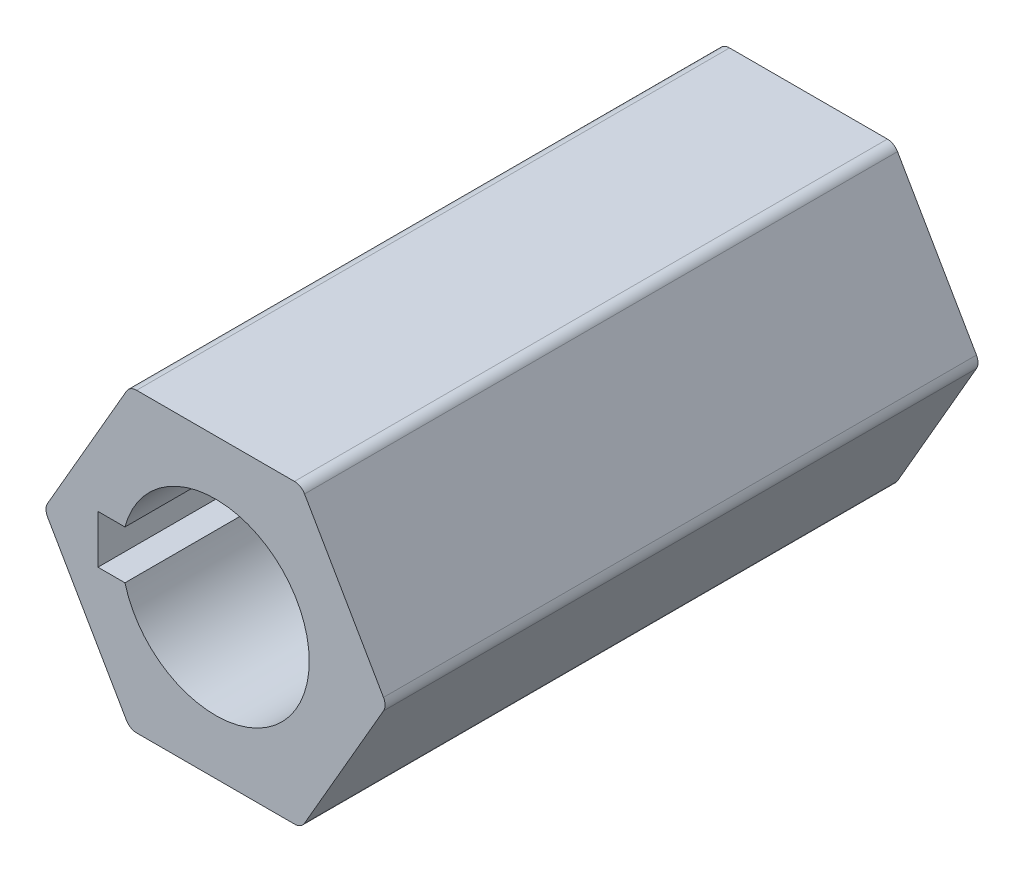
ISO-10303-21;
HEADER;
FILE_DESCRIPTION(('STEP AP214'),'2;1');
FILE_NAME('part.step','',(''),(''),'','','');
FILE_SCHEMA(('AUTOMOTIVE_DESIGN { 1 0 10303 214 1 1 1 1 }'));
ENDSEC;
DATA;
#1=APPLICATION_CONTEXT('core data for automotive mechanical design processes');
#2=APPLICATION_PROTOCOL_DEFINITION('international standard','automotive_design',2000,#1);
#3=PRODUCT_CONTEXT('',#1,'mechanical');
#4=PRODUCT('Part','Part','',(#3));
#5=PRODUCT_RELATED_PRODUCT_CATEGORY('part','',(#4));
#6=PRODUCT_DEFINITION_FORMATION('','',#4);
#7=PRODUCT_DEFINITION_CONTEXT('part definition',#1,'design');
#8=PRODUCT_DEFINITION('design','',#6,#7);
#9=PRODUCT_DEFINITION_SHAPE('','',#8);
#10=(LENGTH_UNIT() NAMED_UNIT(*) SI_UNIT(.MILLI.,.METRE.));
#11=(NAMED_UNIT(*) PLANE_ANGLE_UNIT() SI_UNIT($,.RADIAN.));
#12=(NAMED_UNIT(*) SI_UNIT($,.STERADIAN.) SOLID_ANGLE_UNIT());
#13=UNCERTAINTY_MEASURE_WITH_UNIT(LENGTH_MEASURE(1.E-05),#10,'distance_accuracy_value','');
#14=(GEOMETRIC_REPRESENTATION_CONTEXT(3) GLOBAL_UNCERTAINTY_ASSIGNED_CONTEXT((#13)) GLOBAL_UNIT_ASSIGNED_CONTEXT((#10,
#11,#12)) REPRESENTATION_CONTEXT('',''));
#15=CARTESIAN_POINT('',(0.,0.,0.));
#16=DIRECTION('',(0.,0.,1.));
#17=DIRECTION('',(1.,0.,0.));
#18=AXIS2_PLACEMENT_3D('',#15,#16,#17);
#19=CARTESIAN_POINT('',(6.76233049793735,0.,12.7));
#20=DIRECTION('',(0.,0.,-1.));
#21=DIRECTION('',(-1.,0.,0.));
#22=AXIS2_PLACEMENT_3D('',#19,#20,#21);
#23=CYLINDRICAL_SURFACE('',#22,0.5);
#24=CARTESIAN_POINT('',(6.76233049793735,0.,-12.7));
#25=DIRECTION('',(0.,0.,-1.));
#26=DIRECTION('',(-1.,0.,0.));
#27=AXIS2_PLACEMENT_3D('',#24,#25,#26);
#28=CIRCLE('',#27,0.5);
#29=CARTESIAN_POINT('',(7.19534319982957,-0.250000000000017,-12.7));
#30=VERTEX_POINT('',#29);
#31=CARTESIAN_POINT('',(7.19534319982957,0.249999999999985,-12.7));
#32=VERTEX_POINT('',#31);
#33=EDGE_CURVE('E130',#30,#32,#28,.F.);
#34=ORIENTED_EDGE('',*,*,#33,.T.);
#35=DIRECTION('',(0.,0.,1.));
#36=VECTOR('',#35,1.);
#37=CARTESIAN_POINT('',(7.19534319982957,0.249999999999985,12.7));
#38=LINE('',#37,#36);
#39=CARTESIAN_POINT('',(7.19534319982957,0.249999999999985,12.7));
#40=VERTEX_POINT('',#39);
#41=EDGE_CURVE('E128',#32,#40,#38,.T.);
#42=ORIENTED_EDGE('',*,*,#41,.T.);
#43=CARTESIAN_POINT('',(6.76233049793735,0.,12.7));
#44=DIRECTION('',(0.,0.,-1.));
#45=DIRECTION('',(-1.,0.,0.));
#46=AXIS2_PLACEMENT_3D('',#43,#44,#45);
#47=CIRCLE('',#46,0.5);
#48=CARTESIAN_POINT('',(7.19534319982957,-0.250000000000017,12.7));
#49=VERTEX_POINT('',#48);
#50=EDGE_CURVE('E19',#40,#49,#47,.T.);
#51=ORIENTED_EDGE('',*,*,#50,.T.);
#52=DIRECTION('',(0.,0.,1.));
#53=VECTOR('',#52,1.);
#54=CARTESIAN_POINT('',(7.19534319982957,-0.250000000000018,12.7));
#55=LINE('',#54,#53);
#56=EDGE_CURVE('E125',#49,#30,#55,.F.);
#57=ORIENTED_EDGE('',*,*,#56,.T.);
#58=EDGE_LOOP('',(#34,#42,#51,#57));
#59=FACE_BOUND('',#58,.T.);
#60=ADVANCED_FACE('F16',(#59),#23,.T.);
#61=CARTESIAN_POINT('',(3.38116524896868,5.85635,12.7));
#62=DIRECTION('',(0.,0.,-1.));
#63=DIRECTION('',(-1.,0.,0.));
#64=AXIS2_PLACEMENT_3D('',#61,#62,#63);
#65=CYLINDRICAL_SURFACE('',#64,0.5);
#66=CARTESIAN_POINT('',(3.38116524896868,5.85635,-12.7));
#67=DIRECTION('',(0.,0.,-1.));
#68=DIRECTION('',(-1.,0.,0.));
#69=AXIS2_PLACEMENT_3D('',#66,#67,#68);
#70=CIRCLE('',#69,0.5);
#71=CARTESIAN_POINT('',(3.8141779508609,6.10635,-12.7));
#72=VERTEX_POINT('',#71);
#73=CARTESIAN_POINT('',(3.38116524896868,6.35635,-12.7));
#74=VERTEX_POINT('',#73);
#75=EDGE_CURVE('E227',#72,#74,#70,.F.);
#76=ORIENTED_EDGE('',*,*,#75,.T.);
#77=DIRECTION('',(0.,0.,-1.));
#78=VECTOR('',#77,1.);
#79=CARTESIAN_POINT('',(3.38116524896868,6.35635,12.7));
#80=LINE('',#79,#78);
#81=CARTESIAN_POINT('',(3.38116524896868,6.35635,12.7));
#82=VERTEX_POINT('',#81);
#83=EDGE_CURVE('E194',#74,#82,#80,.F.);
#84=ORIENTED_EDGE('',*,*,#83,.T.);
#85=CARTESIAN_POINT('',(3.38116524896868,5.85635,12.7));
#86=DIRECTION('',(0.,0.,-1.));
#87=DIRECTION('',(-1.,0.,0.));
#88=AXIS2_PLACEMENT_3D('',#85,#86,#87);
#89=CIRCLE('',#88,0.5);
#90=CARTESIAN_POINT('',(3.8141779508609,6.10635,12.7));
#91=VERTEX_POINT('',#90);
#92=EDGE_CURVE('E229',#82,#91,#89,.T.);
#93=ORIENTED_EDGE('',*,*,#92,.T.);
#94=DIRECTION('',(0.,0.,1.));
#95=VECTOR('',#94,1.);
#96=CARTESIAN_POINT('',(3.8141779508609,6.10635,12.7));
#97=LINE('',#96,#95);
#98=EDGE_CURVE('E200',#91,#72,#97,.F.);
#99=ORIENTED_EDGE('',*,*,#98,.T.);
#100=EDGE_LOOP('',(#76,#84,#93,#99));
#101=FACE_BOUND('',#100,.T.);
#102=ADVANCED_FACE('F448',(#101),#65,.T.);
#103=CARTESIAN_POINT('',(-3.38116524896865,5.85635,12.7));
#104=DIRECTION('',(0.,0.,-1.));
#105=DIRECTION('',(-1.,0.,0.));
#106=AXIS2_PLACEMENT_3D('',#103,#104,#105);
#107=CYLINDRICAL_SURFACE('',#106,0.5);
#108=CARTESIAN_POINT('',(-3.38116524896865,5.85635,-12.7));
#109=DIRECTION('',(0.,0.,-1.));
#110=DIRECTION('',(-1.,0.,0.));
#111=AXIS2_PLACEMENT_3D('',#108,#109,#110);
#112=CIRCLE('',#111,0.5);
#113=CARTESIAN_POINT('',(-3.38116524896865,6.35635,-12.7));
#114=VERTEX_POINT('',#113);
#115=CARTESIAN_POINT('',(-3.81417795086087,6.10635,-12.7));
#116=VERTEX_POINT('',#115);
#117=EDGE_CURVE('E223',#114,#116,#112,.F.);
#118=ORIENTED_EDGE('',*,*,#117,.T.);
#119=DIRECTION('',(0.,0.,1.));
#120=VECTOR('',#119,1.);
#121=CARTESIAN_POINT('',(-3.81417795086087,6.10635,12.7));
#122=LINE('',#121,#120);
#123=CARTESIAN_POINT('',(-3.81417795086087,6.10635,12.7));
#124=VERTEX_POINT('',#123);
#125=EDGE_CURVE('E188',#116,#124,#122,.T.);
#126=ORIENTED_EDGE('',*,*,#125,.T.);
#127=CARTESIAN_POINT('',(-3.38116524896865,5.85635,12.7));
#128=DIRECTION('',(0.,0.,-1.));
#129=DIRECTION('',(-1.,0.,0.));
#130=AXIS2_PLACEMENT_3D('',#127,#128,#129);
#131=CIRCLE('',#130,0.5);
#132=CARTESIAN_POINT('',(-3.38116524896865,6.35635,12.7));
#133=VERTEX_POINT('',#132);
#134=EDGE_CURVE('E225',#124,#133,#131,.T.);
#135=ORIENTED_EDGE('',*,*,#134,.T.);
#136=DIRECTION('',(0.,0.,-1.));
#137=VECTOR('',#136,1.);
#138=CARTESIAN_POINT('',(-3.38116524896865,6.35635,12.7));
#139=LINE('',#138,#137);
#140=EDGE_CURVE('E191',#133,#114,#139,.T.);
#141=ORIENTED_EDGE('',*,*,#140,.T.);
#142=EDGE_LOOP('',(#118,#126,#135,#141));
#143=FACE_BOUND('',#142,.T.);
#144=ADVANCED_FACE('F265',(#143),#107,.T.);
#145=CARTESIAN_POINT('',(-6.76233049793731,0.,12.7));
#146=DIRECTION('',(0.,0.,-1.));
#147=DIRECTION('',(-1.,0.,0.));
#148=AXIS2_PLACEMENT_3D('',#145,#146,#147);
#149=CYLINDRICAL_SURFACE('',#148,0.5);
#150=CARTESIAN_POINT('',(-6.76233049793731,0.,-12.7));
#151=DIRECTION('',(0.,0.,-1.));
#152=DIRECTION('',(-1.,0.,0.));
#153=AXIS2_PLACEMENT_3D('',#150,#151,#152);
#154=CIRCLE('',#153,0.5);
#155=CARTESIAN_POINT('',(-7.19534319982953,0.249999999999998,-12.7));
#156=VERTEX_POINT('',#155);
#157=CARTESIAN_POINT('',(-7.19534319982953,-0.25,-12.7));
#158=VERTEX_POINT('',#157);
#159=EDGE_CURVE('E219',#156,#158,#154,.F.);
#160=ORIENTED_EDGE('',*,*,#159,.T.);
#161=DIRECTION('',(0.,0.,1.));
#162=VECTOR('',#161,1.);
#163=CARTESIAN_POINT('',(-7.19534319982953,-0.25,12.7));
#164=LINE('',#163,#162);
#165=CARTESIAN_POINT('',(-7.19534319982953,-0.25,12.7));
#166=VERTEX_POINT('',#165);
#167=EDGE_CURVE('E182',#158,#166,#164,.T.);
#168=ORIENTED_EDGE('',*,*,#167,.T.);
#169=CARTESIAN_POINT('',(-6.76233049793731,0.,12.7));
#170=DIRECTION('',(0.,0.,-1.));
#171=DIRECTION('',(-1.,0.,0.));
#172=AXIS2_PLACEMENT_3D('',#169,#170,#171);
#173=CIRCLE('',#172,0.5);
#174=CARTESIAN_POINT('',(-7.19534319982953,0.249999999999998,12.7));
#175=VERTEX_POINT('',#174);
#176=EDGE_CURVE('E221',#166,#175,#173,.T.);
#177=ORIENTED_EDGE('',*,*,#176,.T.);
#178=DIRECTION('',(0.,0.,1.));
#179=VECTOR('',#178,1.);
#180=CARTESIAN_POINT('',(-7.19534319982953,0.249999999999998,12.7));
#181=LINE('',#180,#179);
#182=EDGE_CURVE('E185',#175,#156,#181,.F.);
#183=ORIENTED_EDGE('',*,*,#182,.T.);
#184=EDGE_LOOP('',(#160,#168,#177,#183));
#185=FACE_BOUND('',#184,.T.);
#186=ADVANCED_FACE('F276',(#185),#149,.T.);
#187=CARTESIAN_POINT('',(3.38116524896867,-5.85635000000002,12.7));
#188=DIRECTION('',(0.,0.,-1.));
#189=DIRECTION('',(-1.,0.,0.));
#190=AXIS2_PLACEMENT_3D('',#187,#188,#189);
#191=CYLINDRICAL_SURFACE('',#190,0.5);
#192=CARTESIAN_POINT('',(3.38116524896867,-5.85635000000002,-12.7));
#193=DIRECTION('',(0.,0.,-1.));
#194=DIRECTION('',(-1.,0.,0.));
#195=AXIS2_PLACEMENT_3D('',#192,#193,#194);
#196=CIRCLE('',#195,0.5);
#197=CARTESIAN_POINT('',(3.38116524896867,-6.35635000000002,-12.7));
#198=VERTEX_POINT('',#197);
#199=CARTESIAN_POINT('',(3.81417795086089,-6.10635000000002,-12.7));
#200=VERTEX_POINT('',#199);
#201=EDGE_CURVE('E216',#198,#200,#196,.F.);
#202=ORIENTED_EDGE('',*,*,#201,.T.);
#203=DIRECTION('',(0.,0.,1.));
#204=VECTOR('',#203,1.);
#205=CARTESIAN_POINT('',(3.81417795086089,-6.10635000000002,12.7));
#206=LINE('',#205,#204);
#207=CARTESIAN_POINT('',(3.81417795086089,-6.10635000000002,12.7));
#208=VERTEX_POINT('',#207);
#209=EDGE_CURVE('E138',#200,#208,#206,.T.);
#210=ORIENTED_EDGE('',*,*,#209,.T.);
#211=CARTESIAN_POINT('',(3.38116524896867,-5.85635000000002,12.7));
#212=DIRECTION('',(0.,0.,-1.));
#213=DIRECTION('',(-1.,0.,0.));
#214=AXIS2_PLACEMENT_3D('',#211,#212,#213);
#215=CIRCLE('',#214,0.5);
#216=CARTESIAN_POINT('',(3.38116524896867,-6.35635000000002,12.7));
#217=VERTEX_POINT('',#216);
#218=EDGE_CURVE('E144',#208,#217,#215,.T.);
#219=ORIENTED_EDGE('',*,*,#218,.T.);
#220=DIRECTION('',(0.,0.,1.));
#221=VECTOR('',#220,1.);
#222=CARTESIAN_POINT('',(3.38116524896867,-6.35635000000002,12.7));
#223=LINE('',#222,#221);
#224=EDGE_CURVE('E178',#217,#198,#223,.F.);
#225=ORIENTED_EDGE('',*,*,#224,.T.);
#226=EDGE_LOOP('',(#202,#210,#219,#225));
#227=FACE_BOUND('',#226,.T.);
#228=ADVANCED_FACE('F294',(#227),#191,.T.);
#229=CARTESIAN_POINT('',(-3.38116524896863,-5.85635000000002,12.7));
#230=DIRECTION('',(0.,0.,-1.));
#231=DIRECTION('',(-1.,0.,0.));
#232=AXIS2_PLACEMENT_3D('',#229,#230,#231);
#233=CYLINDRICAL_SURFACE('',#232,0.5);
#234=CARTESIAN_POINT('',(-3.38116524896863,-5.85635000000002,-12.7));
#235=DIRECTION('',(0.,0.,-1.));
#236=DIRECTION('',(-1.,0.,0.));
#237=AXIS2_PLACEMENT_3D('',#234,#235,#236);
#238=CIRCLE('',#237,0.5);
#239=CARTESIAN_POINT('',(-3.81417795086084,-6.10635000000002,-12.7));
#240=VERTEX_POINT('',#239);
#241=CARTESIAN_POINT('',(-3.38116524896863,-6.35635000000002,-12.7));
#242=VERTEX_POINT('',#241);
#243=EDGE_CURVE('E139',#240,#242,#238,.F.);
#244=ORIENTED_EDGE('',*,*,#243,.T.);
#245=DIRECTION('',(0.,0.,1.));
#246=VECTOR('',#245,1.);
#247=CARTESIAN_POINT('',(-3.38116524896863,-6.35635000000002,12.7));
#248=LINE('',#247,#246);
#249=CARTESIAN_POINT('',(-3.38116524896863,-6.35635000000002,12.7));
#250=VERTEX_POINT('',#249);
#251=EDGE_CURVE('E160',#242,#250,#248,.T.);
#252=ORIENTED_EDGE('',*,*,#251,.T.);
#253=CARTESIAN_POINT('',(-3.38116524896863,-5.85635000000002,12.7));
#254=DIRECTION('',(0.,0.,-1.));
#255=DIRECTION('',(-1.,0.,0.));
#256=AXIS2_PLACEMENT_3D('',#253,#254,#255);
#257=CIRCLE('',#256,0.5);
#258=CARTESIAN_POINT('',(-3.81417795086084,-6.10635000000002,12.7));
#259=VERTEX_POINT('',#258);
#260=EDGE_CURVE('E214',#250,#259,#257,.T.);
#261=ORIENTED_EDGE('',*,*,#260,.T.);
#262=DIRECTION('',(0.,0.,1.));
#263=VECTOR('',#262,1.);
#264=CARTESIAN_POINT('',(-3.81417795086084,-6.10635000000002,12.7));
#265=LINE('',#264,#263);
#266=EDGE_CURVE('E181',#259,#240,#265,.F.);
#267=ORIENTED_EDGE('',*,*,#266,.T.);
#268=EDGE_LOOP('',(#244,#252,#261,#267));
#269=FACE_BOUND('',#268,.T.);
#270=ADVANCED_FACE('F284',(#269),#233,.T.);
#271=CARTESIAN_POINT('',(3.66984038356348,-6.35635000000002,12.7));
#272=DIRECTION('',(-0.866025403784438,0.500000000000001,0.));
#273=DIRECTION('',(-0.500000000000001,-0.866025403784438,0.));
#274=AXIS2_PLACEMENT_3D('',#271,#272,#273);
#275=PLANE('',#274);
#276=ORIENTED_EDGE('',*,*,#209,.F.);
#277=DIRECTION('',(0.500000000000001,0.866025403784438,0.));
#278=VECTOR('',#277,1.);
#279=CARTESIAN_POINT('',(3.81417795086089,-6.10635000000002,-12.7));
#280=LINE('',#279,#278);
#281=EDGE_CURVE('E137',#200,#30,#280,.T.);
#282=ORIENTED_EDGE('',*,*,#281,.T.);
#283=ORIENTED_EDGE('',*,*,#56,.F.);
#284=DIRECTION('',(0.500000000000001,0.866025403784438,0.));
#285=VECTOR('',#284,1.);
#286=CARTESIAN_POINT('',(3.81417795086089,-6.10635000000002,12.7));
#287=LINE('',#286,#285);
#288=EDGE_CURVE('E135',#208,#49,#287,.T.);
#289=ORIENTED_EDGE('',*,*,#288,.F.);
#290=EDGE_LOOP('',(#276,#282,#283,#289));
#291=FACE_BOUND('',#290,.T.);
#292=ADVANCED_FACE('F134',(#291),#275,.F.);
#293=CARTESIAN_POINT('',(7.33968076712697,0.,12.7));
#294=DIRECTION('',(-0.866025403784439,-0.5,0.));
#295=DIRECTION('',(0.5,-0.866025403784439,0.));
#296=AXIS2_PLACEMENT_3D('',#293,#294,#295);
#297=PLANE('',#296);
#298=ORIENTED_EDGE('',*,*,#41,.F.);
#299=DIRECTION('',(-0.5,0.866025403784439,0.));
#300=VECTOR('',#299,1.);
#301=CARTESIAN_POINT('',(7.19534319982957,0.249999999999985,-12.7));
#302=LINE('',#301,#300);
#303=EDGE_CURVE('E236',#32,#72,#302,.T.);
#304=ORIENTED_EDGE('',*,*,#303,.T.);
#305=ORIENTED_EDGE('',*,*,#98,.F.);
#306=DIRECTION('',(-0.5,0.866025403784439,0.));
#307=VECTOR('',#306,1.);
#308=CARTESIAN_POINT('',(7.19534319982957,0.249999999999985,12.7));
#309=LINE('',#308,#307);
#310=EDGE_CURVE('E146',#40,#91,#309,.T.);
#311=ORIENTED_EDGE('',*,*,#310,.F.);
#312=EDGE_LOOP('',(#298,#304,#305,#311));
#313=FACE_BOUND('',#312,.T.);
#314=ADVANCED_FACE('F234',(#313),#297,.F.);
#315=CARTESIAN_POINT('',(3.66984038356349,6.35635,12.7));
#316=DIRECTION('',(0.,-1.,0.));
#317=DIRECTION('',(0.,0.,-1.));
#318=AXIS2_PLACEMENT_3D('',#315,#316,#317);
#319=PLANE('',#318);
#320=ORIENTED_EDGE('',*,*,#140,.F.);
#321=DIRECTION('',(1.,0.,0.));
#322=VECTOR('',#321,1.);
#323=CARTESIAN_POINT('',(0.,6.35635,12.7));
#324=LINE('',#323,#322);
#325=EDGE_CURVE('E149',#82,#133,#324,.F.);
#326=ORIENTED_EDGE('',*,*,#325,.F.);
#327=ORIENTED_EDGE('',*,*,#83,.F.);
#328=DIRECTION('',(1.,0.,0.));
#329=VECTOR('',#328,1.);
#330=CARTESIAN_POINT('',(0.,6.35635,-12.7));
#331=LINE('',#330,#329);
#332=EDGE_CURVE('E239',#74,#114,#331,.F.);
#333=ORIENTED_EDGE('',*,*,#332,.T.);
#334=EDGE_LOOP('',(#320,#326,#327,#333));
#335=FACE_BOUND('',#334,.T.);
#336=ADVANCED_FACE('F263',(#335),#319,.F.);
#337=CARTESIAN_POINT('',(-3.66984038356347,6.35635,12.7));
#338=DIRECTION('',(0.866025403784439,-0.499999999999999,0.));
#339=DIRECTION('',(0.499999999999999,0.866025403784439,0.));
#340=AXIS2_PLACEMENT_3D('',#337,#338,#339);
#341=PLANE('',#340);
#342=ORIENTED_EDGE('',*,*,#182,.F.);
#343=DIRECTION('',(-0.499999999999999,-0.866025403784439,0.));
#344=VECTOR('',#343,1.);
#345=CARTESIAN_POINT('',(-3.81417795086087,6.10635,12.7));
#346=LINE('',#345,#344);
#347=EDGE_CURVE('E255',#124,#175,#346,.T.);
#348=ORIENTED_EDGE('',*,*,#347,.F.);
#349=ORIENTED_EDGE('',*,*,#125,.F.);
#350=DIRECTION('',(-0.499999999999999,-0.866025403784439,0.));
#351=VECTOR('',#350,1.);
#352=CARTESIAN_POINT('',(-3.81417795086087,6.10635,-12.7));
#353=LINE('',#352,#351);
#354=EDGE_CURVE('E242',#116,#156,#353,.T.);
#355=ORIENTED_EDGE('',*,*,#354,.T.);
#356=EDGE_LOOP('',(#342,#348,#349,#355));
#357=FACE_BOUND('',#356,.T.);
#358=ADVANCED_FACE('F272',(#357),#341,.F.);
#359=CARTESIAN_POINT('',(-7.33968076712694,0.,12.7));
#360=DIRECTION('',(0.866025403784438,0.500000000000001,0.));
#361=DIRECTION('',(-0.500000000000001,0.866025403784438,0.));
#362=AXIS2_PLACEMENT_3D('',#359,#360,#361);
#363=PLANE('',#362);
#364=ORIENTED_EDGE('',*,*,#266,.F.);
#365=DIRECTION('',(0.500000000000001,-0.866025403784438,0.));
#366=VECTOR('',#365,1.);
#367=CARTESIAN_POINT('',(-7.19534319982953,-0.25,12.7));
#368=LINE('',#367,#366);
#369=EDGE_CURVE('E151',#166,#259,#368,.T.);
#370=ORIENTED_EDGE('',*,*,#369,.F.);
#371=ORIENTED_EDGE('',*,*,#167,.F.);
#372=DIRECTION('',(0.500000000000001,-0.866025403784438,0.));
#373=VECTOR('',#372,1.);
#374=CARTESIAN_POINT('',(-7.19534319982953,-0.25,-12.7));
#375=LINE('',#374,#373);
#376=EDGE_CURVE('E282',#158,#240,#375,.T.);
#377=ORIENTED_EDGE('',*,*,#376,.T.);
#378=EDGE_LOOP('',(#364,#370,#371,#377));
#379=FACE_BOUND('',#378,.T.);
#380=ADVANCED_FACE('F281',(#379),#363,.F.);
#381=CARTESIAN_POINT('',(-3.66984038356344,-6.35635000000002,12.7));
#382=DIRECTION('',(0.,1.,0.));
#383=DIRECTION('',(0.,0.,1.));
#384=AXIS2_PLACEMENT_3D('',#381,#382,#383);
#385=PLANE('',#384);
#386=ORIENTED_EDGE('',*,*,#251,.F.);
#387=DIRECTION('',(1.,0.,0.));
#388=VECTOR('',#387,1.);
#389=CARTESIAN_POINT('',(0.,-6.35635000000002,-12.7));
#390=LINE('',#389,#388);
#391=EDGE_CURVE('E292',#242,#198,#390,.T.);
#392=ORIENTED_EDGE('',*,*,#391,.T.);
#393=ORIENTED_EDGE('',*,*,#224,.F.);
#394=DIRECTION('',(1.,0.,0.));
#395=VECTOR('',#394,1.);
#396=CARTESIAN_POINT('',(0.,-6.35635000000002,12.7));
#397=LINE('',#396,#395);
#398=EDGE_CURVE('E147',#250,#217,#397,.T.);
#399=ORIENTED_EDGE('',*,*,#398,.F.);
#400=EDGE_LOOP('',(#386,#392,#393,#399));
#401=FACE_BOUND('',#400,.T.);
#402=ADVANCED_FACE('F289',(#401),#385,.F.);
#403=CARTESIAN_POINT('',(-5.035,-1.035,12.7));
#404=DIRECTION('',(1.,0.,0.));
#405=DIRECTION('',(0.,0.,-1.));
#406=AXIS2_PLACEMENT_3D('',#403,#404,#405);
#407=PLANE('',#406);
#408=DIRECTION('',(0.,1.,0.));
#409=VECTOR('',#408,1.);
#410=CARTESIAN_POINT('',(-5.035,0.,12.7));
#411=LINE('',#410,#409);
#412=CARTESIAN_POINT('',(-5.035,-1.035,12.7));
#413=VERTEX_POINT('',#412);
#414=CARTESIAN_POINT('',(-5.035,1.035,12.7));
#415=VERTEX_POINT('',#414);
#416=EDGE_CURVE('E173',#413,#415,#411,.T.);
#417=ORIENTED_EDGE('',*,*,#416,.F.);
#418=DIRECTION('',(0.,0.,1.));
#419=VECTOR('',#418,1.);
#420=CARTESIAN_POINT('',(-5.035,-1.035,12.7));
#421=LINE('',#420,#419);
#422=CARTESIAN_POINT('',(-5.035,-1.035,-12.7));
#423=VERTEX_POINT('',#422);
#424=EDGE_CURVE('E169',#423,#413,#421,.T.);
#425=ORIENTED_EDGE('',*,*,#424,.F.);
#426=DIRECTION('',(0.,1.,0.));
#427=VECTOR('',#426,1.);
#428=CARTESIAN_POINT('',(-5.035,0.,-12.7));
#429=LINE('',#428,#427);
#430=CARTESIAN_POINT('',(-5.035,1.035,-12.7));
#431=VERTEX_POINT('',#430);
#432=EDGE_CURVE('E163',#423,#431,#429,.T.);
#433=ORIENTED_EDGE('',*,*,#432,.T.);
#434=DIRECTION('',(0.,0.,1.));
#435=VECTOR('',#434,1.);
#436=CARTESIAN_POINT('',(-5.035,1.035,12.7));
#437=LINE('',#436,#435);
#438=EDGE_CURVE('E157',#415,#431,#437,.F.);
#439=ORIENTED_EDGE('',*,*,#438,.F.);
#440=EDGE_LOOP('',(#417,#425,#433,#439));
#441=FACE_BOUND('',#440,.T.);
#442=ADVANCED_FACE('F322',(#441),#407,.T.);
#443=CARTESIAN_POINT('',(-3.87930406129759,1.035,12.7));
#444=DIRECTION('',(0.,-1.,0.));
#445=DIRECTION('',(1.,0.,0.));
#446=AXIS2_PLACEMENT_3D('',#443,#444,#445);
#447=PLANE('',#446);
#448=DIRECTION('',(1.,0.,0.));
#449=VECTOR('',#448,1.);
#450=CARTESIAN_POINT('',(0.,1.035,12.7));
#451=LINE('',#450,#449);
#452=CARTESIAN_POINT('',(-3.87930406129759,1.035,12.7));
#453=VERTEX_POINT('',#452);
#454=EDGE_CURVE('E206',#415,#453,#451,.T.);
#455=ORIENTED_EDGE('',*,*,#454,.F.);
#456=ORIENTED_EDGE('',*,*,#438,.T.);
#457=DIRECTION('',(1.,0.,0.));
#458=VECTOR('',#457,1.);
#459=CARTESIAN_POINT('',(0.,1.035,-12.7));
#460=LINE('',#459,#458);
#461=CARTESIAN_POINT('',(-3.87930406129759,1.035,-12.7));
#462=VERTEX_POINT('',#461);
#463=EDGE_CURVE('E166',#431,#462,#460,.T.);
#464=ORIENTED_EDGE('',*,*,#463,.T.);
#465=DIRECTION('',(0.,0.,-1.));
#466=VECTOR('',#465,1.);
#467=CARTESIAN_POINT('',(-3.87930406129759,1.035,12.7));
#468=LINE('',#467,#466);
#469=EDGE_CURVE('E212',#462,#453,#468,.F.);
#470=ORIENTED_EDGE('',*,*,#469,.T.);
#471=EDGE_LOOP('',(#455,#456,#464,#470));
#472=FACE_BOUND('',#471,.T.);
#473=ADVANCED_FACE('F307',(#472),#447,.T.);
#474=CARTESIAN_POINT('',(0.,0.,12.7));
#475=DIRECTION('',(0.,0.,1.));
#476=DIRECTION('',(1.,0.,0.));
#477=AXIS2_PLACEMENT_3D('',#474,#475,#476);
#478=PLANE('',#477);
#479=DIRECTION('',(-1.,0.,0.));
#480=VECTOR('',#479,1.);
#481=CARTESIAN_POINT('',(-3.87930406129759,-1.035,12.7));
#482=LINE('',#481,#480);
#483=CARTESIAN_POINT('',(-3.87930406129759,-1.035,12.7));
#484=VERTEX_POINT('',#483);
#485=EDGE_CURVE('E172',#413,#484,#482,.F.);
#486=ORIENTED_EDGE('',*,*,#485,.F.);
#487=ORIENTED_EDGE('',*,*,#416,.T.);
#488=ORIENTED_EDGE('',*,*,#454,.T.);
#489=CARTESIAN_POINT('',(0.,0.,12.7));
#490=DIRECTION('',(0.,0.,-1.));
#491=DIRECTION('',(-1.,0.,0.));
#492=AXIS2_PLACEMENT_3D('',#489,#490,#491);
#493=CIRCLE('',#492,4.015);
#494=EDGE_CURVE('E209',#453,#484,#493,.T.);
#495=ORIENTED_EDGE('',*,*,#494,.T.);
#496=EDGE_LOOP('',(#486,#487,#488,#495));
#497=FACE_BOUND('',#496,.T.);
#498=ORIENTED_EDGE('',*,*,#347,.T.);
#499=ORIENTED_EDGE('',*,*,#176,.F.);
#500=ORIENTED_EDGE('',*,*,#369,.T.);
#501=ORIENTED_EDGE('',*,*,#260,.F.);
#502=ORIENTED_EDGE('',*,*,#398,.T.);
#503=ORIENTED_EDGE('',*,*,#218,.F.);
#504=ORIENTED_EDGE('',*,*,#288,.T.);
#505=ORIENTED_EDGE('',*,*,#50,.F.);
#506=ORIENTED_EDGE('',*,*,#310,.T.);
#507=ORIENTED_EDGE('',*,*,#92,.F.);
#508=ORIENTED_EDGE('',*,*,#325,.T.);
#509=ORIENTED_EDGE('',*,*,#134,.F.);
#510=EDGE_LOOP('',(#498,#499,#500,#501,#502,#503,#504,#505,#506,#507,#508,#509));
#511=FACE_BOUND('',#510,.T.);
#512=ADVANCED_FACE('F142',(#497,#511),#478,.T.);
#513=CARTESIAN_POINT('',(-3.87930406129759,-1.035,12.7));
#514=DIRECTION('',(0.,1.,0.));
#515=DIRECTION('',(-1.,0.,0.));
#516=AXIS2_PLACEMENT_3D('',#513,#514,#515);
#517=PLANE('',#516);
#518=ORIENTED_EDGE('',*,*,#485,.T.);
#519=DIRECTION('',(0.,0.,-1.));
#520=VECTOR('',#519,1.);
#521=CARTESIAN_POINT('',(-3.87930406129759,-1.035,12.7));
#522=LINE('',#521,#520);
#523=CARTESIAN_POINT('',(-3.87930406129759,-1.035,-12.7));
#524=VERTEX_POINT('',#523);
#525=EDGE_CURVE('E25',#484,#524,#522,.T.);
#526=ORIENTED_EDGE('',*,*,#525,.T.);
#527=DIRECTION('',(1.,0.,0.));
#528=VECTOR('',#527,1.);
#529=CARTESIAN_POINT('',(0.,-1.035,-12.7));
#530=LINE('',#529,#528);
#531=EDGE_CURVE('E33',#524,#423,#530,.F.);
#532=ORIENTED_EDGE('',*,*,#531,.T.);
#533=ORIENTED_EDGE('',*,*,#424,.T.);
#534=EDGE_LOOP('',(#518,#526,#532,#533));
#535=FACE_BOUND('',#534,.T.);
#536=ADVANCED_FACE('F314',(#535),#517,.T.);
#537=CARTESIAN_POINT('',(0.,0.,-12.7));
#538=DIRECTION('',(0.,0.,1.));
#539=DIRECTION('',(1.,0.,0.));
#540=AXIS2_PLACEMENT_3D('',#537,#538,#539);
#541=PLANE('',#540);
#542=ORIENTED_EDGE('',*,*,#463,.F.);
#543=ORIENTED_EDGE('',*,*,#432,.F.);
#544=ORIENTED_EDGE('',*,*,#531,.F.);
#545=CARTESIAN_POINT('',(0.,0.,-12.7));
#546=DIRECTION('',(0.,0.,-1.));
#547=DIRECTION('',(-1.,0.,0.));
#548=AXIS2_PLACEMENT_3D('',#545,#546,#547);
#549=CIRCLE('',#548,4.015);
#550=EDGE_CURVE('E11',#524,#462,#549,.F.);
#551=ORIENTED_EDGE('',*,*,#550,.T.);
#552=EDGE_LOOP('',(#542,#543,#544,#551));
#553=FACE_BOUND('',#552,.T.);
#554=ORIENTED_EDGE('',*,*,#243,.F.);
#555=ORIENTED_EDGE('',*,*,#376,.F.);
#556=ORIENTED_EDGE('',*,*,#159,.F.);
#557=ORIENTED_EDGE('',*,*,#354,.F.);
#558=ORIENTED_EDGE('',*,*,#117,.F.);
#559=ORIENTED_EDGE('',*,*,#332,.F.);
#560=ORIENTED_EDGE('',*,*,#75,.F.);
#561=ORIENTED_EDGE('',*,*,#303,.F.);
#562=ORIENTED_EDGE('',*,*,#33,.F.);
#563=ORIENTED_EDGE('',*,*,#281,.F.);
#564=ORIENTED_EDGE('',*,*,#201,.F.);
#565=ORIENTED_EDGE('',*,*,#391,.F.);
#566=EDGE_LOOP('',(#554,#555,#556,#557,#558,#559,#560,#561,#562,#563,#564,#565));
#567=FACE_BOUND('',#566,.T.);
#568=ADVANCED_FACE('F237',(#553,#567),#541,.F.);
#569=CARTESIAN_POINT('',(0.,0.,12.7));
#570=DIRECTION('',(0.,0.,-1.));
#571=DIRECTION('',(-1.,0.,0.));
#572=AXIS2_PLACEMENT_3D('',#569,#570,#571);
#573=CYLINDRICAL_SURFACE('',#572,4.015);
#574=ORIENTED_EDGE('',*,*,#525,.F.);
#575=ORIENTED_EDGE('',*,*,#494,.F.);
#576=ORIENTED_EDGE('',*,*,#469,.F.);
#577=ORIENTED_EDGE('',*,*,#550,.F.);
#578=EDGE_LOOP('',(#574,#575,#576,#577));
#579=FACE_BOUND('',#578,.T.);
#580=ADVANCED_FACE('F311',(#579),#573,.F.);
#581=CLOSED_SHELL('',(#60,#102,#144,#186,#228,#270,#292,#314,#336,#358,#380,#402,#442,#473,#512,
#536,#568,#580));
#582=MANIFOLD_SOLID_BREP('B1',#581);
#583=ADVANCED_BREP_SHAPE_REPRESENTATION('',(#18,#582),#14);
#584=SHAPE_DEFINITION_REPRESENTATION(#9,#583);
ENDSEC;
END-ISO-10303-21;
